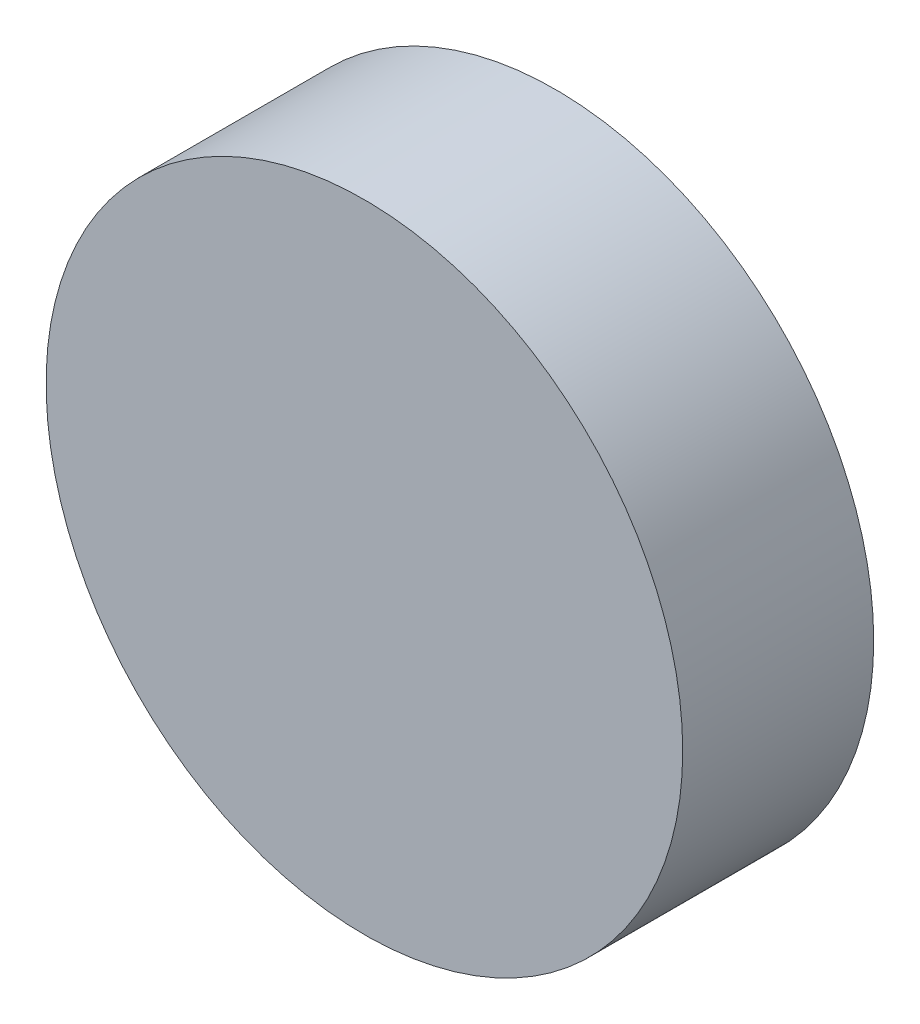
ISO-10303-21;
HEADER;
FILE_DESCRIPTION(('STEP AP214'),'2;1');
FILE_NAME('part.step','',(''),(''),'','','');
FILE_SCHEMA(('AUTOMOTIVE_DESIGN { 1 0 10303 214 1 1 1 1 }'));
ENDSEC;
DATA;
#1=APPLICATION_CONTEXT('core data for automotive mechanical design processes');
#2=APPLICATION_PROTOCOL_DEFINITION('international standard','automotive_design',2000,#1);
#3=PRODUCT_CONTEXT('',#1,'mechanical');
#4=PRODUCT('Part','Part','',(#3));
#5=PRODUCT_RELATED_PRODUCT_CATEGORY('part','',(#4));
#6=PRODUCT_DEFINITION_FORMATION('','',#4);
#7=PRODUCT_DEFINITION_CONTEXT('part definition',#1,'design');
#8=PRODUCT_DEFINITION('design','',#6,#7);
#9=PRODUCT_DEFINITION_SHAPE('','',#8);
#10=(LENGTH_UNIT() NAMED_UNIT(*) SI_UNIT(.MILLI.,.METRE.));
#11=(NAMED_UNIT(*) PLANE_ANGLE_UNIT() SI_UNIT($,.RADIAN.));
#12=(NAMED_UNIT(*) SI_UNIT($,.STERADIAN.) SOLID_ANGLE_UNIT());
#13=UNCERTAINTY_MEASURE_WITH_UNIT(LENGTH_MEASURE(1.E-05),#10,'distance_accuracy_value','');
#14=(GEOMETRIC_REPRESENTATION_CONTEXT(3) GLOBAL_UNCERTAINTY_ASSIGNED_CONTEXT((#13)) GLOBAL_UNIT_ASSIGNED_CONTEXT((#10,
#11,#12)) REPRESENTATION_CONTEXT('',''));
#15=CARTESIAN_POINT('',(0.,0.,0.));
#16=DIRECTION('',(0.,0.,1.));
#17=DIRECTION('',(1.,0.,0.));
#18=AXIS2_PLACEMENT_3D('',#15,#16,#17);
#19=CARTESIAN_POINT('',(0.,0.,6.));
#20=DIRECTION('',(0.,0.,-1.));
#21=DIRECTION('',(-1.,0.,0.));
#22=AXIS2_PLACEMENT_3D('',#19,#20,#21);
#23=CYLINDRICAL_SURFACE('',#22,10.);
#24=CARTESIAN_POINT('',(0.,0.,6.));
#25=DIRECTION('',(0.,0.,1.));
#26=DIRECTION('',(1.,0.,0.));
#27=AXIS2_PLACEMENT_3D('',#24,#25,#26);
#28=CIRCLE('',#27,10.);
#29=CARTESIAN_POINT('',(10.,0.,6.));
#30=VERTEX_POINT('',#29);
#31=EDGE_CURVE('E10',#30,#30,#28,.T.);
#32=ORIENTED_EDGE('',*,*,#31,.F.);
#33=EDGE_LOOP('',(#32));
#34=FACE_BOUND('',#33,.T.);
#35=CARTESIAN_POINT('',(0.,0.,0.));
#36=DIRECTION('',(0.,0.,1.));
#37=DIRECTION('',(1.,0.,0.));
#38=AXIS2_PLACEMENT_3D('',#35,#36,#37);
#39=CIRCLE('',#38,10.);
#40=CARTESIAN_POINT('',(10.,0.,0.));
#41=VERTEX_POINT('',#40);
#42=EDGE_CURVE('E40',#41,#41,#39,.T.);
#43=ORIENTED_EDGE('',*,*,#42,.T.);
#44=EDGE_LOOP('',(#43));
#45=FACE_BOUND('',#44,.T.);
#46=ADVANCED_FACE('F37',(#34,#45),#23,.T.);
#47=CARTESIAN_POINT('',(0.,0.,6.));
#48=DIRECTION('',(0.,0.,1.));
#49=DIRECTION('',(1.,0.,0.));
#50=AXIS2_PLACEMENT_3D('',#47,#48,#49);
#51=PLANE('',#50);
#52=ORIENTED_EDGE('',*,*,#31,.T.);
#53=EDGE_LOOP('',(#52));
#54=FACE_BOUND('',#53,.T.);
#55=ADVANCED_FACE('F54',(#54),#51,.T.);
#56=CARTESIAN_POINT('',(0.,0.,0.));
#57=DIRECTION('',(0.,0.,1.));
#58=DIRECTION('',(1.,0.,0.));
#59=AXIS2_PLACEMENT_3D('',#56,#57,#58);
#60=PLANE('',#59);
#61=ORIENTED_EDGE('',*,*,#42,.F.);
#62=EDGE_LOOP('',(#61));
#63=FACE_BOUND('',#62,.T.);
#64=ADVANCED_FACE('F52',(#63),#60,.F.);
#65=CLOSED_SHELL('',(#46,#55,#64));
#66=MANIFOLD_SOLID_BREP('B2',#65);
#67=ADVANCED_BREP_SHAPE_REPRESENTATION('',(#18,#66),#14);
#68=SHAPE_DEFINITION_REPRESENTATION(#9,#67);
ENDSEC;
END-ISO-10303-21;
